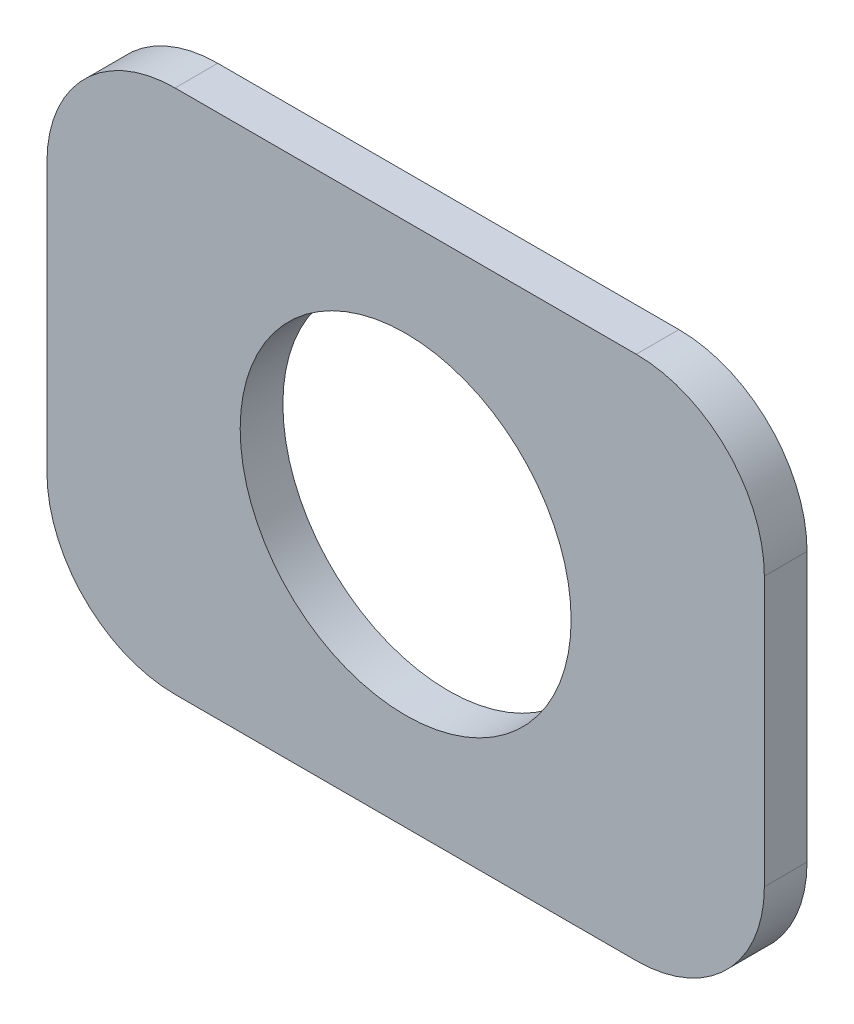
ISO-10303-21;
HEADER;
FILE_DESCRIPTION(('STEP AP214'),'2;1');
FILE_NAME('part.step','',(''),(''),'','','');
FILE_SCHEMA(('AUTOMOTIVE_DESIGN { 1 0 10303 214 1 1 1 1 }'));
ENDSEC;
DATA;
#1=APPLICATION_CONTEXT('core data for automotive mechanical design processes');
#2=APPLICATION_PROTOCOL_DEFINITION('international standard','automotive_design',2000,#1);
#3=PRODUCT_CONTEXT('',#1,'mechanical');
#4=PRODUCT('Part','Part','',(#3));
#5=PRODUCT_RELATED_PRODUCT_CATEGORY('part','',(#4));
#6=PRODUCT_DEFINITION_FORMATION('','',#4);
#7=PRODUCT_DEFINITION_CONTEXT('part definition',#1,'design');
#8=PRODUCT_DEFINITION('design','',#6,#7);
#9=PRODUCT_DEFINITION_SHAPE('','',#8);
#10=(LENGTH_UNIT() NAMED_UNIT(*) SI_UNIT(.MILLI.,.METRE.));
#11=(NAMED_UNIT(*) PLANE_ANGLE_UNIT() SI_UNIT($,.RADIAN.));
#12=(NAMED_UNIT(*) SI_UNIT($,.STERADIAN.) SOLID_ANGLE_UNIT());
#13=UNCERTAINTY_MEASURE_WITH_UNIT(LENGTH_MEASURE(1.E-05),#10,'distance_accuracy_value','');
#14=(GEOMETRIC_REPRESENTATION_CONTEXT(3) GLOBAL_UNCERTAINTY_ASSIGNED_CONTEXT((#13)) GLOBAL_UNIT_ASSIGNED_CONTEXT((#10,
#11,#12)) REPRESENTATION_CONTEXT('',''));
#15=CARTESIAN_POINT('',(0.,0.,0.));
#16=DIRECTION('',(0.,0.,1.));
#17=DIRECTION('',(1.,0.,0.));
#18=AXIS2_PLACEMENT_3D('',#15,#16,#17);
#19=CARTESIAN_POINT('',(-2.7432,1.60020000000001,0.508));
#20=DIRECTION('',(0.,0.,1.));
#21=DIRECTION('',(1.,0.,0.));
#22=AXIS2_PLACEMENT_3D('',#19,#20,#21);
#23=PLANE('',#22);
#24=CARTESIAN_POINT('',(-2.7432,1.60020000000001,0.508));
#25=DIRECTION('',(0.,0.,1.));
#26=DIRECTION('',(1.,0.,0.));
#27=AXIS2_PLACEMENT_3D('',#24,#25,#26);
#28=CIRCLE('',#27,1.524);
#29=CARTESIAN_POINT('',(-2.7432,3.12420000000001,0.508));
#30=VERTEX_POINT('',#29);
#31=CARTESIAN_POINT('',(-4.2672,1.60020000000001,0.508));
#32=VERTEX_POINT('',#31);
#33=EDGE_CURVE('E142',#30,#32,#28,.T.);
#34=ORIENTED_EDGE('',*,*,#33,.T.);
#35=DIRECTION('',(0.,-1.,0.));
#36=VECTOR('',#35,1.);
#37=CARTESIAN_POINT('',(-4.2672,1.60020000000001,0.508));
#38=LINE('',#37,#36);
#39=CARTESIAN_POINT('',(-4.2672,-1.60020000000001,0.508));
#40=VERTEX_POINT('',#39);
#41=EDGE_CURVE('E90',#32,#40,#38,.T.);
#42=ORIENTED_EDGE('',*,*,#41,.T.);
#43=CARTESIAN_POINT('',(-2.7432,-1.60020000000001,0.508));
#44=DIRECTION('',(0.,0.,1.));
#45=DIRECTION('',(1.,0.,0.));
#46=AXIS2_PLACEMENT_3D('',#43,#44,#45);
#47=CIRCLE('',#46,1.524);
#48=CARTESIAN_POINT('',(-2.7432,-3.12420000000001,0.508));
#49=VERTEX_POINT('',#48);
#50=EDGE_CURVE('E157',#40,#49,#47,.T.);
#51=ORIENTED_EDGE('',*,*,#50,.T.);
#52=DIRECTION('',(1.,0.,0.));
#53=VECTOR('',#52,1.);
#54=CARTESIAN_POINT('',(-2.7432,-3.12420000000001,0.508));
#55=LINE('',#54,#53);
#56=CARTESIAN_POINT('',(2.7432,-3.12420000000001,0.508));
#57=VERTEX_POINT('',#56);
#58=EDGE_CURVE('E170',#49,#57,#55,.T.);
#59=ORIENTED_EDGE('',*,*,#58,.T.);
#60=CARTESIAN_POINT('',(2.7432,-1.6002,0.508));
#61=DIRECTION('',(0.,0.,1.));
#62=DIRECTION('',(1.,0.,0.));
#63=AXIS2_PLACEMENT_3D('',#60,#61,#62);
#64=CIRCLE('',#63,1.524);
#65=CARTESIAN_POINT('',(4.2672,-1.6002,0.508));
#66=VERTEX_POINT('',#65);
#67=EDGE_CURVE('E109',#57,#66,#64,.T.);
#68=ORIENTED_EDGE('',*,*,#67,.T.);
#69=DIRECTION('',(0.,1.,0.));
#70=VECTOR('',#69,1.);
#71=CARTESIAN_POINT('',(4.2672,-1.6002,0.508));
#72=LINE('',#71,#70);
#73=CARTESIAN_POINT('',(4.2672,1.60020000000001,0.508));
#74=VERTEX_POINT('',#73);
#75=EDGE_CURVE('E103',#66,#74,#72,.T.);
#76=ORIENTED_EDGE('',*,*,#75,.T.);
#77=CARTESIAN_POINT('',(2.7432,1.60020000000001,0.508));
#78=DIRECTION('',(0.,0.,1.));
#79=DIRECTION('',(1.,0.,0.));
#80=AXIS2_PLACEMENT_3D('',#77,#78,#79);
#81=CIRCLE('',#80,1.524);
#82=CARTESIAN_POINT('',(2.7432,3.12420000000001,0.508));
#83=VERTEX_POINT('',#82);
#84=EDGE_CURVE('E107',#74,#83,#81,.T.);
#85=ORIENTED_EDGE('',*,*,#84,.T.);
#86=DIRECTION('',(-1.,0.,0.));
#87=VECTOR('',#86,1.);
#88=CARTESIAN_POINT('',(2.7432,3.12420000000001,0.508));
#89=LINE('',#88,#87);
#90=EDGE_CURVE('E47',#83,#30,#89,.T.);
#91=ORIENTED_EDGE('',*,*,#90,.T.);
#92=EDGE_LOOP('',(#34,#42,#51,#59,#68,#76,#85,#91));
#93=FACE_BOUND('',#92,.T.);
#94=CARTESIAN_POINT('',(0.,0.,0.508));
#95=DIRECTION('',(0.,0.,1.));
#96=DIRECTION('',(1.,0.,0.));
#97=AXIS2_PLACEMENT_3D('',#94,#95,#96);
#98=CIRCLE('',#97,1.9685);
#99=CARTESIAN_POINT('',(1.9685,0.,0.508));
#100=VERTEX_POINT('',#99);
#101=EDGE_CURVE('E131',#100,#100,#98,.T.);
#102=ORIENTED_EDGE('',*,*,#101,.F.);
#103=EDGE_LOOP('',(#102));
#104=FACE_BOUND('',#103,.T.);
#105=ADVANCED_FACE('F30',(#93,#104),#23,.T.);
#106=CARTESIAN_POINT('',(-2.7432,1.60020000000001,0.));
#107=DIRECTION('',(0.,0.,1.));
#108=DIRECTION('',(1.,0.,0.));
#109=AXIS2_PLACEMENT_3D('',#106,#107,#108);
#110=PLANE('',#109);
#111=CARTESIAN_POINT('',(-2.7432,1.60020000000001,0.));
#112=DIRECTION('',(0.,0.,1.));
#113=DIRECTION('',(1.,0.,0.));
#114=AXIS2_PLACEMENT_3D('',#111,#112,#113);
#115=CIRCLE('',#114,1.524);
#116=CARTESIAN_POINT('',(-2.7432,3.12420000000001,0.));
#117=VERTEX_POINT('',#116);
#118=CARTESIAN_POINT('',(-4.2672,1.60020000000001,0.));
#119=VERTEX_POINT('',#118);
#120=EDGE_CURVE('E127',#117,#119,#115,.T.);
#121=ORIENTED_EDGE('',*,*,#120,.F.);
#122=DIRECTION('',(-1.,0.,0.));
#123=VECTOR('',#122,1.);
#124=CARTESIAN_POINT('',(2.7432,3.12420000000001,0.));
#125=LINE('',#124,#123);
#126=CARTESIAN_POINT('',(2.7432,3.12420000000001,0.));
#127=VERTEX_POINT('',#126);
#128=EDGE_CURVE('E82',#127,#117,#125,.T.);
#129=ORIENTED_EDGE('',*,*,#128,.F.);
#130=CARTESIAN_POINT('',(2.7432,1.60020000000001,0.));
#131=DIRECTION('',(0.,0.,1.));
#132=DIRECTION('',(1.,0.,0.));
#133=AXIS2_PLACEMENT_3D('',#130,#131,#132);
#134=CIRCLE('',#133,1.524);
#135=CARTESIAN_POINT('',(4.2672,1.60020000000001,0.));
#136=VERTEX_POINT('',#135);
#137=EDGE_CURVE('E76',#136,#127,#134,.T.);
#138=ORIENTED_EDGE('',*,*,#137,.F.);
#139=DIRECTION('',(0.,1.,0.));
#140=VECTOR('',#139,1.);
#141=CARTESIAN_POINT('',(4.2672,-1.6002,0.));
#142=LINE('',#141,#140);
#143=CARTESIAN_POINT('',(4.2672,-1.6002,0.));
#144=VERTEX_POINT('',#143);
#145=EDGE_CURVE('E117',#144,#136,#142,.T.);
#146=ORIENTED_EDGE('',*,*,#145,.F.);
#147=CARTESIAN_POINT('',(2.7432,-1.6002,0.));
#148=DIRECTION('',(0.,0.,1.));
#149=DIRECTION('',(1.,0.,0.));
#150=AXIS2_PLACEMENT_3D('',#147,#148,#149);
#151=CIRCLE('',#150,1.524);
#152=CARTESIAN_POINT('',(2.7432,-3.12420000000001,0.));
#153=VERTEX_POINT('',#152);
#154=EDGE_CURVE('E137',#153,#144,#151,.T.);
#155=ORIENTED_EDGE('',*,*,#154,.F.);
#156=DIRECTION('',(1.,0.,0.));
#157=VECTOR('',#156,1.);
#158=CARTESIAN_POINT('',(-2.7432,-3.12420000000001,0.));
#159=LINE('',#158,#157);
#160=CARTESIAN_POINT('',(-2.7432,-3.12420000000001,0.));
#161=VERTEX_POINT('',#160);
#162=EDGE_CURVE('E135',#161,#153,#159,.T.);
#163=ORIENTED_EDGE('',*,*,#162,.F.);
#164=CARTESIAN_POINT('',(-2.7432,-1.60020000000001,0.));
#165=DIRECTION('',(0.,0.,1.));
#166=DIRECTION('',(1.,0.,0.));
#167=AXIS2_PLACEMENT_3D('',#164,#165,#166);
#168=CIRCLE('',#167,1.524);
#169=CARTESIAN_POINT('',(-4.2672,-1.60020000000001,0.));
#170=VERTEX_POINT('',#169);
#171=EDGE_CURVE('E133',#170,#161,#168,.T.);
#172=ORIENTED_EDGE('',*,*,#171,.F.);
#173=DIRECTION('',(0.,-1.,0.));
#174=VECTOR('',#173,1.);
#175=CARTESIAN_POINT('',(-4.2672,1.60020000000001,0.));
#176=LINE('',#175,#174);
#177=EDGE_CURVE('E130',#119,#170,#176,.T.);
#178=ORIENTED_EDGE('',*,*,#177,.F.);
#179=EDGE_LOOP('',(#121,#129,#138,#146,#155,#163,#172,#178));
#180=FACE_BOUND('',#179,.T.);
#181=CARTESIAN_POINT('',(0.,0.,0.));
#182=DIRECTION('',(0.,0.,1.));
#183=DIRECTION('',(1.,0.,0.));
#184=AXIS2_PLACEMENT_3D('',#181,#182,#183);
#185=CIRCLE('',#184,1.9685);
#186=CARTESIAN_POINT('',(1.9685,0.,0.));
#187=VERTEX_POINT('',#186);
#188=EDGE_CURVE('E176',#187,#187,#185,.T.);
#189=ORIENTED_EDGE('',*,*,#188,.T.);
#190=EDGE_LOOP('',(#189));
#191=FACE_BOUND('',#190,.T.);
#192=ADVANCED_FACE('F161',(#180,#191),#110,.F.);
#193=CARTESIAN_POINT('',(-2.7432,1.60020000000001,0.508));
#194=DIRECTION('',(0.,0.,-1.));
#195=DIRECTION('',(-1.,0.,0.));
#196=AXIS2_PLACEMENT_3D('',#193,#194,#195);
#197=CYLINDRICAL_SURFACE('',#196,1.524);
#198=ORIENTED_EDGE('',*,*,#120,.T.);
#199=DIRECTION('',(0.,0.,-1.));
#200=VECTOR('',#199,1.);
#201=CARTESIAN_POINT('',(-4.2672,1.60020000000001,0.508));
#202=LINE('',#201,#200);
#203=EDGE_CURVE('E11',#32,#119,#202,.T.);
#204=ORIENTED_EDGE('',*,*,#203,.F.);
#205=ORIENTED_EDGE('',*,*,#33,.F.);
#206=DIRECTION('',(0.,0.,-1.));
#207=VECTOR('',#206,1.);
#208=CARTESIAN_POINT('',(-2.7432,3.12420000000001,0.508));
#209=LINE('',#208,#207);
#210=EDGE_CURVE('E123',#30,#117,#209,.T.);
#211=ORIENTED_EDGE('',*,*,#210,.T.);
#212=EDGE_LOOP('',(#198,#204,#205,#211));
#213=FACE_BOUND('',#212,.T.);
#214=ADVANCED_FACE('F32',(#213),#197,.T.);
#215=CARTESIAN_POINT('',(-4.2672,1.60020000000001,0.508));
#216=DIRECTION('',(1.,0.,0.));
#217=DIRECTION('',(0.,0.,-1.));
#218=AXIS2_PLACEMENT_3D('',#215,#216,#217);
#219=PLANE('',#218);
#220=ORIENTED_EDGE('',*,*,#177,.T.);
#221=DIRECTION('',(0.,0.,-1.));
#222=VECTOR('',#221,1.);
#223=CARTESIAN_POINT('',(-4.2672,-1.60020000000001,0.508));
#224=LINE('',#223,#222);
#225=EDGE_CURVE('E39',#40,#170,#224,.T.);
#226=ORIENTED_EDGE('',*,*,#225,.F.);
#227=ORIENTED_EDGE('',*,*,#41,.F.);
#228=ORIENTED_EDGE('',*,*,#203,.T.);
#229=EDGE_LOOP('',(#220,#226,#227,#228));
#230=FACE_BOUND('',#229,.T.);
#231=ADVANCED_FACE('F204',(#230),#219,.F.);
#232=CARTESIAN_POINT('',(-2.7432,-1.60020000000001,0.508));
#233=DIRECTION('',(0.,0.,-1.));
#234=DIRECTION('',(-1.,0.,0.));
#235=AXIS2_PLACEMENT_3D('',#232,#233,#234);
#236=CYLINDRICAL_SURFACE('',#235,1.524);
#237=ORIENTED_EDGE('',*,*,#171,.T.);
#238=DIRECTION('',(0.,0.,-1.));
#239=VECTOR('',#238,1.);
#240=CARTESIAN_POINT('',(-2.7432,-3.12420000000001,0.508));
#241=LINE('',#240,#239);
#242=EDGE_CURVE('E149',#49,#161,#241,.T.);
#243=ORIENTED_EDGE('',*,*,#242,.F.);
#244=ORIENTED_EDGE('',*,*,#50,.F.);
#245=ORIENTED_EDGE('',*,*,#225,.T.);
#246=EDGE_LOOP('',(#237,#243,#244,#245));
#247=FACE_BOUND('',#246,.T.);
#248=ADVANCED_FACE('F155',(#247),#236,.T.);
#249=CARTESIAN_POINT('',(-2.7432,-3.12420000000001,0.508));
#250=DIRECTION('',(0.,1.,0.));
#251=DIRECTION('',(-1.,0.,0.));
#252=AXIS2_PLACEMENT_3D('',#249,#250,#251);
#253=PLANE('',#252);
#254=ORIENTED_EDGE('',*,*,#162,.T.);
#255=DIRECTION('',(0.,0.,-1.));
#256=VECTOR('',#255,1.);
#257=CARTESIAN_POINT('',(2.7432,-3.12420000000001,0.508));
#258=LINE('',#257,#256);
#259=EDGE_CURVE('E146',#57,#153,#258,.T.);
#260=ORIENTED_EDGE('',*,*,#259,.F.);
#261=ORIENTED_EDGE('',*,*,#58,.F.);
#262=ORIENTED_EDGE('',*,*,#242,.T.);
#263=EDGE_LOOP('',(#254,#260,#261,#262));
#264=FACE_BOUND('',#263,.T.);
#265=ADVANCED_FACE('F166',(#264),#253,.F.);
#266=CARTESIAN_POINT('',(2.7432,-1.6002,0.508));
#267=DIRECTION('',(0.,0.,-1.));
#268=DIRECTION('',(-1.,0.,0.));
#269=AXIS2_PLACEMENT_3D('',#266,#267,#268);
#270=CYLINDRICAL_SURFACE('',#269,1.524);
#271=ORIENTED_EDGE('',*,*,#154,.T.);
#272=DIRECTION('',(0.,0.,-1.));
#273=VECTOR('',#272,1.);
#274=CARTESIAN_POINT('',(4.2672,-1.6002,0.508));
#275=LINE('',#274,#273);
#276=EDGE_CURVE('E118',#66,#144,#275,.T.);
#277=ORIENTED_EDGE('',*,*,#276,.F.);
#278=ORIENTED_EDGE('',*,*,#67,.F.);
#279=ORIENTED_EDGE('',*,*,#259,.T.);
#280=EDGE_LOOP('',(#271,#277,#278,#279));
#281=FACE_BOUND('',#280,.T.);
#282=ADVANCED_FACE('F169',(#281),#270,.T.);
#283=CARTESIAN_POINT('',(4.2672,-1.6002,0.508));
#284=DIRECTION('',(-1.,0.,0.));
#285=DIRECTION('',(0.,0.,1.));
#286=AXIS2_PLACEMENT_3D('',#283,#284,#285);
#287=PLANE('',#286);
#288=ORIENTED_EDGE('',*,*,#145,.T.);
#289=DIRECTION('',(0.,0.,-1.));
#290=VECTOR('',#289,1.);
#291=CARTESIAN_POINT('',(4.2672,1.60020000000001,0.508));
#292=LINE('',#291,#290);
#293=EDGE_CURVE('E114',#74,#136,#292,.T.);
#294=ORIENTED_EDGE('',*,*,#293,.F.);
#295=ORIENTED_EDGE('',*,*,#75,.F.);
#296=ORIENTED_EDGE('',*,*,#276,.T.);
#297=EDGE_LOOP('',(#288,#294,#295,#296));
#298=FACE_BOUND('',#297,.T.);
#299=ADVANCED_FACE('F115',(#298),#287,.F.);
#300=CARTESIAN_POINT('',(2.7432,1.60020000000001,0.508));
#301=DIRECTION('',(0.,0.,-1.));
#302=DIRECTION('',(-1.,0.,0.));
#303=AXIS2_PLACEMENT_3D('',#300,#301,#302);
#304=CYLINDRICAL_SURFACE('',#303,1.524);
#305=ORIENTED_EDGE('',*,*,#137,.T.);
#306=DIRECTION('',(0.,0.,-1.));
#307=VECTOR('',#306,1.);
#308=CARTESIAN_POINT('',(2.7432,3.12420000000001,0.508));
#309=LINE('',#308,#307);
#310=EDGE_CURVE('E119',#83,#127,#309,.T.);
#311=ORIENTED_EDGE('',*,*,#310,.F.);
#312=ORIENTED_EDGE('',*,*,#84,.F.);
#313=ORIENTED_EDGE('',*,*,#293,.T.);
#314=EDGE_LOOP('',(#305,#311,#312,#313));
#315=FACE_BOUND('',#314,.T.);
#316=ADVANCED_FACE('F121',(#315),#304,.T.);
#317=CARTESIAN_POINT('',(2.7432,3.12420000000001,0.508));
#318=DIRECTION('',(0.,-1.,0.));
#319=DIRECTION('',(0.,0.,-1.));
#320=AXIS2_PLACEMENT_3D('',#317,#318,#319);
#321=PLANE('',#320);
#322=ORIENTED_EDGE('',*,*,#128,.T.);
#323=ORIENTED_EDGE('',*,*,#210,.F.);
#324=ORIENTED_EDGE('',*,*,#90,.F.);
#325=ORIENTED_EDGE('',*,*,#310,.T.);
#326=EDGE_LOOP('',(#322,#323,#324,#325));
#327=FACE_BOUND('',#326,.T.);
#328=ADVANCED_FACE('F192',(#327),#321,.F.);
#329=CARTESIAN_POINT('',(0.,0.,0.508));
#330=DIRECTION('',(0.,0.,-1.));
#331=DIRECTION('',(-1.,0.,0.));
#332=AXIS2_PLACEMENT_3D('',#329,#330,#331);
#333=CYLINDRICAL_SURFACE('',#332,1.9685);
#334=ORIENTED_EDGE('',*,*,#101,.T.);
#335=EDGE_LOOP('',(#334));
#336=FACE_BOUND('',#335,.T.);
#337=ORIENTED_EDGE('',*,*,#188,.F.);
#338=EDGE_LOOP('',(#337));
#339=FACE_BOUND('',#338,.T.);
#340=ADVANCED_FACE('F182',(#336,#339),#333,.F.);
#341=CLOSED_SHELL('',(#105,#192,#214,#231,#248,#265,#282,#299,#316,#328,#340));
#342=MANIFOLD_SOLID_BREP('B2',#341);
#343=ADVANCED_BREP_SHAPE_REPRESENTATION('',(#18,#342),#14);
#344=SHAPE_DEFINITION_REPRESENTATION(#9,#343);
ENDSEC;
END-ISO-10303-21;
